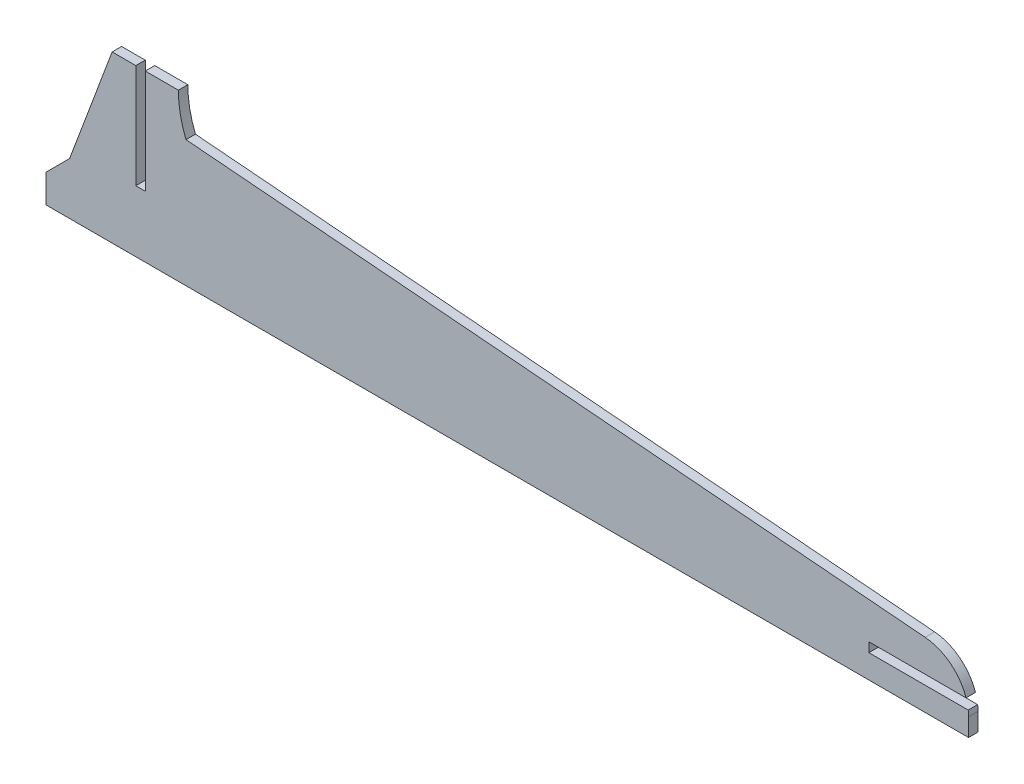
ISO-10303-21;
HEADER;
FILE_DESCRIPTION(('STEP AP214'),'2;1');
FILE_NAME('part.step','',(''),(''),'','','');
FILE_SCHEMA(('AUTOMOTIVE_DESIGN { 1 0 10303 214 1 1 1 1 }'));
ENDSEC;
DATA;
#1=APPLICATION_CONTEXT('core data for automotive mechanical design processes');
#2=APPLICATION_PROTOCOL_DEFINITION('international standard','automotive_design',2000,#1);
#3=PRODUCT_CONTEXT('',#1,'mechanical');
#4=PRODUCT('Part','Part','',(#3));
#5=PRODUCT_RELATED_PRODUCT_CATEGORY('part','',(#4));
#6=PRODUCT_DEFINITION_FORMATION('','',#4);
#7=PRODUCT_DEFINITION_CONTEXT('part definition',#1,'design');
#8=PRODUCT_DEFINITION('design','',#6,#7);
#9=PRODUCT_DEFINITION_SHAPE('','',#8);
#10=(LENGTH_UNIT() NAMED_UNIT(*) SI_UNIT(.MILLI.,.METRE.));
#11=(NAMED_UNIT(*) PLANE_ANGLE_UNIT() SI_UNIT($,.RADIAN.));
#12=(NAMED_UNIT(*) SI_UNIT($,.STERADIAN.) SOLID_ANGLE_UNIT());
#13=UNCERTAINTY_MEASURE_WITH_UNIT(LENGTH_MEASURE(1.E-05),#10,'distance_accuracy_value','');
#14=(GEOMETRIC_REPRESENTATION_CONTEXT(3) GLOBAL_UNCERTAINTY_ASSIGNED_CONTEXT((#13)) GLOBAL_UNIT_ASSIGNED_CONTEXT((#10,
#11,#12)) REPRESENTATION_CONTEXT('',''));
#15=CARTESIAN_POINT('',(0.,0.,0.));
#16=DIRECTION('',(0.,0.,1.));
#17=DIRECTION('',(1.,0.,0.));
#18=AXIS2_PLACEMENT_3D('',#15,#16,#17);
#19=CARTESIAN_POINT('',(85.6103921399042,-10.3842909651718,2.));
#20=DIRECTION('',(0.,0.,-1.));
#21=DIRECTION('',(-1.,0.,0.));
#22=AXIS2_PLACEMENT_3D('',#19,#20,#21);
#23=CYLINDRICAL_SURFACE('',#22,10.);
#24=CARTESIAN_POINT('',(85.6103921399042,-10.3842909651718,0.));
#25=DIRECTION('',(0.,0.,1.));
#26=DIRECTION('',(1.,0.,0.));
#27=AXIS2_PLACEMENT_3D('',#24,#25,#26);
#28=CIRCLE('',#27,10.);
#29=CARTESIAN_POINT('',(95.6103921399042,-10.3842909651718,0.));
#30=VERTEX_POINT('',#29);
#31=CARTESIAN_POINT('',(95.537713689397,-9.18084306311038,0.));
#32=VERTEX_POINT('',#31);
#33=EDGE_CURVE('E186',#30,#32,#28,.T.);
#34=ORIENTED_EDGE('',*,*,#33,.T.);
#35=DIRECTION('',(0.,0.,-1.));
#36=VECTOR('',#35,1.);
#37=CARTESIAN_POINT('',(95.537713689397,-9.18084306311038,2.));
#38=LINE('',#37,#36);
#39=CARTESIAN_POINT('',(95.537713689397,-9.18084306311038,2.));
#40=VERTEX_POINT('',#39);
#41=EDGE_CURVE('E11',#40,#32,#38,.T.);
#42=ORIENTED_EDGE('',*,*,#41,.F.);
#43=CARTESIAN_POINT('',(85.6103921399042,-10.3842909651718,2.));
#44=DIRECTION('',(0.,0.,1.));
#45=DIRECTION('',(1.,0.,0.));
#46=AXIS2_PLACEMENT_3D('',#43,#44,#45);
#47=CIRCLE('',#46,10.);
#48=CARTESIAN_POINT('',(95.6103921399042,-10.3842909651718,2.));
#49=VERTEX_POINT('',#48);
#50=EDGE_CURVE('E218',#49,#40,#47,.T.);
#51=ORIENTED_EDGE('',*,*,#50,.F.);
#52=DIRECTION('',(0.,0.,-1.));
#53=VECTOR('',#52,1.);
#54=CARTESIAN_POINT('',(95.6103921399042,-10.3842909651718,2.));
#55=LINE('',#54,#53);
#56=EDGE_CURVE('E182',#49,#30,#55,.T.);
#57=ORIENTED_EDGE('',*,*,#56,.T.);
#58=EDGE_LOOP('',(#34,#42,#51,#57));
#59=FACE_BOUND('',#58,.T.);
#60=ADVANCED_FACE('F36',(#59),#23,.T.);
#61=CARTESIAN_POINT('',(74.537713689397,-9.18084306311038,2.));
#62=DIRECTION('',(0.,-1.,0.));
#63=DIRECTION('',(1.,0.,0.));
#64=AXIS2_PLACEMENT_3D('',#61,#62,#63);
#65=PLANE('',#64);
#66=DIRECTION('',(-1.,0.,0.));
#67=VECTOR('',#66,1.);
#68=CARTESIAN_POINT('',(74.537713689397,-9.18084306311038,0.));
#69=LINE('',#68,#67);
#70=CARTESIAN_POINT('',(74.537713689397,-9.18084306311038,0.));
#71=VERTEX_POINT('',#70);
#72=EDGE_CURVE('E189',#32,#71,#69,.T.);
#73=ORIENTED_EDGE('',*,*,#72,.T.);
#74=DIRECTION('',(0.,0.,-1.));
#75=VECTOR('',#74,1.);
#76=CARTESIAN_POINT('',(74.537713689397,-9.18084306311038,2.));
#77=LINE('',#76,#75);
#78=CARTESIAN_POINT('',(74.537713689397,-9.18084306311038,2.));
#79=VERTEX_POINT('',#78);
#80=EDGE_CURVE('E44',#79,#71,#77,.T.);
#81=ORIENTED_EDGE('',*,*,#80,.F.);
#82=DIRECTION('',(-1.,0.,0.));
#83=VECTOR('',#82,1.);
#84=CARTESIAN_POINT('',(74.537713689397,-9.18084306311038,2.));
#85=LINE('',#84,#83);
#86=EDGE_CURVE('E122',#40,#79,#85,.T.);
#87=ORIENTED_EDGE('',*,*,#86,.F.);
#88=ORIENTED_EDGE('',*,*,#41,.T.);
#89=EDGE_LOOP('',(#73,#81,#87,#88));
#90=FACE_BOUND('',#89,.T.);
#91=ADVANCED_FACE('F321',(#90),#65,.F.);
#92=CARTESIAN_POINT('',(74.537713689397,-7.18084306311038,2.));
#93=DIRECTION('',(-1.,0.,0.));
#94=DIRECTION('',(0.,-1.,0.));
#95=AXIS2_PLACEMENT_3D('',#92,#93,#94);
#96=PLANE('',#95);
#97=DIRECTION('',(0.,1.,0.));
#98=VECTOR('',#97,1.);
#99=CARTESIAN_POINT('',(74.537713689397,-7.18084306311038,0.));
#100=LINE('',#99,#98);
#101=CARTESIAN_POINT('',(74.537713689397,-7.18084306311038,0.));
#102=VERTEX_POINT('',#101);
#103=EDGE_CURVE('E191',#71,#102,#100,.T.);
#104=ORIENTED_EDGE('',*,*,#103,.T.);
#105=DIRECTION('',(0.,0.,-1.));
#106=VECTOR('',#105,1.);
#107=CARTESIAN_POINT('',(74.537713689397,-7.18084306311038,2.));
#108=LINE('',#107,#106);
#109=CARTESIAN_POINT('',(74.537713689397,-7.18084306311038,2.));
#110=VERTEX_POINT('',#109);
#111=EDGE_CURVE('E252',#110,#102,#108,.T.);
#112=ORIENTED_EDGE('',*,*,#111,.F.);
#113=DIRECTION('',(0.,1.,0.));
#114=VECTOR('',#113,1.);
#115=CARTESIAN_POINT('',(74.537713689397,-7.18084306311038,2.));
#116=LINE('',#115,#114);
#117=EDGE_CURVE('E260',#79,#110,#116,.T.);
#118=ORIENTED_EDGE('',*,*,#117,.F.);
#119=ORIENTED_EDGE('',*,*,#80,.T.);
#120=EDGE_LOOP('',(#104,#112,#118,#119));
#121=FACE_BOUND('',#120,.T.);
#122=ADVANCED_FACE('F258',(#121),#96,.F.);
#123=CARTESIAN_POINT('',(74.537713689397,-7.18084306311038,2.));
#124=DIRECTION('',(0.,1.,0.));
#125=DIRECTION('',(0.,0.,1.));
#126=AXIS2_PLACEMENT_3D('',#123,#124,#125);
#127=PLANE('',#126);
#128=DIRECTION('',(1.,0.,0.));
#129=VECTOR('',#128,1.);
#130=CARTESIAN_POINT('',(74.537713689397,-7.18084306311038,0.));
#131=LINE('',#130,#129);
#132=CARTESIAN_POINT('',(95.0834023024016,-7.18084306311038,0.));
#133=VERTEX_POINT('',#132);
#134=EDGE_CURVE('E193',#102,#133,#131,.T.);
#135=ORIENTED_EDGE('',*,*,#134,.T.);
#136=DIRECTION('',(0.,0.,-1.));
#137=VECTOR('',#136,1.);
#138=CARTESIAN_POINT('',(95.0834023024016,-7.18084306311038,2.));
#139=LINE('',#138,#137);
#140=CARTESIAN_POINT('',(95.0834023024016,-7.18084306311038,2.));
#141=VERTEX_POINT('',#140);
#142=EDGE_CURVE('E249',#141,#133,#139,.T.);
#143=ORIENTED_EDGE('',*,*,#142,.F.);
#144=DIRECTION('',(1.,0.,0.));
#145=VECTOR('',#144,1.);
#146=CARTESIAN_POINT('',(74.537713689397,-7.18084306311038,2.));
#147=LINE('',#146,#145);
#148=EDGE_CURVE('E278',#110,#141,#147,.T.);
#149=ORIENTED_EDGE('',*,*,#148,.F.);
#150=ORIENTED_EDGE('',*,*,#111,.T.);
#151=EDGE_LOOP('',(#135,#143,#149,#150));
#152=FACE_BOUND('',#151,.T.);
#153=ADVANCED_FACE('F269',(#152),#127,.F.);
#154=CARTESIAN_POINT('',(85.6103921399042,-10.3842909651718,2.));
#155=DIRECTION('',(0.,0.,-1.));
#156=DIRECTION('',(-1.,0.,0.));
#157=AXIS2_PLACEMENT_3D('',#154,#155,#156);
#158=CYLINDRICAL_SURFACE('',#157,10.);
#159=CARTESIAN_POINT('',(85.6103921399042,-10.3842909651718,0.));
#160=DIRECTION('',(0.,0.,1.));
#161=DIRECTION('',(1.,0.,0.));
#162=AXIS2_PLACEMENT_3D('',#159,#160,#161);
#163=CIRCLE('',#162,10.);
#164=CARTESIAN_POINT('',(86.4385600188425,-0.418643070313409,0.));
#165=VERTEX_POINT('',#164);
#166=EDGE_CURVE('E195',#133,#165,#163,.T.);
#167=ORIENTED_EDGE('',*,*,#166,.T.);
#168=DIRECTION('',(0.,0.,-1.));
#169=VECTOR('',#168,1.);
#170=CARTESIAN_POINT('',(86.4385600188425,-0.418643070313409,2.));
#171=LINE('',#170,#169);
#172=CARTESIAN_POINT('',(86.4385600188425,-0.418643070313409,2.));
#173=VERTEX_POINT('',#172);
#174=EDGE_CURVE('E246',#173,#165,#171,.T.);
#175=ORIENTED_EDGE('',*,*,#174,.F.);
#176=CARTESIAN_POINT('',(85.6103921399042,-10.3842909651718,2.));
#177=DIRECTION('',(0.,0.,1.));
#178=DIRECTION('',(1.,0.,0.));
#179=AXIS2_PLACEMENT_3D('',#176,#177,#178);
#180=CIRCLE('',#179,10.);
#181=EDGE_CURVE('E275',#141,#173,#180,.T.);
#182=ORIENTED_EDGE('',*,*,#181,.F.);
#183=ORIENTED_EDGE('',*,*,#142,.T.);
#184=EDGE_LOOP('',(#167,#175,#182,#183));
#185=FACE_BOUND('',#184,.T.);
#186=ADVANCED_FACE('F273',(#185),#158,.T.);
#187=CARTESIAN_POINT('',(-69.8017208567902,12.5652776323497,2.));
#188=DIRECTION('',(-0.0828167878938338,-0.996564789485836,0.));
#189=DIRECTION('',(0.996564789485836,-0.0828167878938338,0.));
#190=AXIS2_PLACEMENT_3D('',#187,#188,#189);
#191=PLANE('',#190);
#192=DIRECTION('',(-0.996564789485836,0.0828167878938338,0.));
#193=VECTOR('',#192,1.);
#194=CARTESIAN_POINT('',(-69.8017208567902,12.5652776323497,0.));
#195=LINE('',#194,#193);
#196=CARTESIAN_POINT('',(-69.8017208567902,12.5652776323498,0.));
#197=VERTEX_POINT('',#196);
#198=EDGE_CURVE('E197',#165,#197,#195,.T.);
#199=ORIENTED_EDGE('',*,*,#198,.T.);
#200=DIRECTION('',(0.,0.,-1.));
#201=VECTOR('',#200,1.);
#202=CARTESIAN_POINT('',(-69.8017208567902,12.5652776323498,2.));
#203=LINE('',#202,#201);
#204=CARTESIAN_POINT('',(-69.8017208567902,12.5652776323498,2.));
#205=VERTEX_POINT('',#204);
#206=EDGE_CURVE('E243',#205,#197,#203,.T.);
#207=ORIENTED_EDGE('',*,*,#206,.F.);
#208=DIRECTION('',(-0.996564789485836,0.0828167878938338,0.));
#209=VECTOR('',#208,1.);
#210=CARTESIAN_POINT('',(-69.8017208567902,12.5652776323497,2.));
#211=LINE('',#210,#209);
#212=EDGE_CURVE('E277',#173,#205,#211,.T.);
#213=ORIENTED_EDGE('',*,*,#212,.F.);
#214=ORIENTED_EDGE('',*,*,#174,.T.);
#215=EDGE_LOOP('',(#199,#207,#213,#214));
#216=FACE_BOUND('',#215,.T.);
#217=ADVANCED_FACE('F334',(#216),#191,.F.);
#218=CARTESIAN_POINT('',(-49.4352382364816,20.8191569368896,2.));
#219=DIRECTION('',(0.,0.,-1.));
#220=DIRECTION('',(-1.,0.,0.));
#221=AXIS2_PLACEMENT_3D('',#218,#219,#220);
#222=CYLINDRICAL_SURFACE('',#221,21.9754439749745);
#223=CARTESIAN_POINT('',(-49.4352382364816,20.8191569368896,0.));
#224=DIRECTION('',(0.,0.,-1.));
#225=DIRECTION('',(1.,0.,0.));
#226=AXIS2_PLACEMENT_3D('',#223,#224,#225);
#227=CIRCLE('',#226,21.9754439749745);
#228=CARTESIAN_POINT('',(-71.4106822114561,20.8191569368896,0.));
#229=VERTEX_POINT('',#228);
#230=EDGE_CURVE('E199',#197,#229,#227,.T.);
#231=ORIENTED_EDGE('',*,*,#230,.T.);
#232=DIRECTION('',(0.,0.,-1.));
#233=VECTOR('',#232,1.);
#234=CARTESIAN_POINT('',(-71.4106822114561,20.8191569368896,2.));
#235=LINE('',#234,#233);
#236=CARTESIAN_POINT('',(-71.4106822114561,20.8191569368896,2.));
#237=VERTEX_POINT('',#236);
#238=EDGE_CURVE('E240',#237,#229,#235,.T.);
#239=ORIENTED_EDGE('',*,*,#238,.F.);
#240=CARTESIAN_POINT('',(-49.4352382364816,20.8191569368896,2.));
#241=DIRECTION('',(0.,0.,-1.));
#242=DIRECTION('',(1.,0.,0.));
#243=AXIS2_PLACEMENT_3D('',#240,#241,#242);
#244=CIRCLE('',#243,21.9754439749745);
#245=EDGE_CURVE('E280',#205,#237,#244,.T.);
#246=ORIENTED_EDGE('',*,*,#245,.F.);
#247=ORIENTED_EDGE('',*,*,#206,.T.);
#248=EDGE_LOOP('',(#231,#239,#246,#247));
#249=FACE_BOUND('',#248,.T.);
#250=ADVANCED_FACE('F337',(#249),#222,.F.);
#251=CARTESIAN_POINT('',(-78.4106822114561,20.8191569368896,2.));
#252=DIRECTION('',(0.,-1.,0.));
#253=DIRECTION('',(0.,0.,-1.));
#254=AXIS2_PLACEMENT_3D('',#251,#252,#253);
#255=PLANE('',#254);
#256=DIRECTION('',(-1.,0.,0.));
#257=VECTOR('',#256,1.);
#258=CARTESIAN_POINT('',(-78.4106822114561,20.8191569368896,0.));
#259=LINE('',#258,#257);
#260=CARTESIAN_POINT('',(-78.4106822114561,20.8191569368896,0.));
#261=VERTEX_POINT('',#260);
#262=EDGE_CURVE('E201',#229,#261,#259,.T.);
#263=ORIENTED_EDGE('',*,*,#262,.T.);
#264=DIRECTION('',(0.,0.,-1.));
#265=VECTOR('',#264,1.);
#266=CARTESIAN_POINT('',(-78.4106822114561,20.8191569368896,2.));
#267=LINE('',#266,#265);
#268=CARTESIAN_POINT('',(-78.4106822114561,20.8191569368896,2.));
#269=VERTEX_POINT('',#268);
#270=EDGE_CURVE('E237',#269,#261,#267,.T.);
#271=ORIENTED_EDGE('',*,*,#270,.F.);
#272=DIRECTION('',(-1.,0.,0.));
#273=VECTOR('',#272,1.);
#274=CARTESIAN_POINT('',(-78.4106822114561,20.8191569368896,2.));
#275=LINE('',#274,#273);
#276=EDGE_CURVE('E286',#237,#269,#275,.T.);
#277=ORIENTED_EDGE('',*,*,#276,.F.);
#278=ORIENTED_EDGE('',*,*,#238,.T.);
#279=EDGE_LOOP('',(#263,#271,#277,#278));
#280=FACE_BOUND('',#279,.T.);
#281=ADVANCED_FACE('F341',(#280),#255,.F.);
#282=CARTESIAN_POINT('',(-78.4106822114561,20.8191569368896,2.));
#283=DIRECTION('',(1.,0.,0.));
#284=DIRECTION('',(0.,0.,-1.));
#285=AXIS2_PLACEMENT_3D('',#282,#283,#284);
#286=PLANE('',#285);
#287=DIRECTION('',(0.,-1.,0.));
#288=VECTOR('',#287,1.);
#289=CARTESIAN_POINT('',(-78.4106822114561,20.8191569368896,0.));
#290=LINE('',#289,#288);
#291=CARTESIAN_POINT('',(-78.4106822114561,-1.18084306311037,0.));
#292=VERTEX_POINT('',#291);
#293=EDGE_CURVE('E203',#261,#292,#290,.T.);
#294=ORIENTED_EDGE('',*,*,#293,.T.);
#295=DIRECTION('',(0.,0.,-1.));
#296=VECTOR('',#295,1.);
#297=CARTESIAN_POINT('',(-78.4106822114561,-1.18084306311037,2.));
#298=LINE('',#297,#296);
#299=CARTESIAN_POINT('',(-78.4106822114561,-1.18084306311037,2.));
#300=VERTEX_POINT('',#299);
#301=EDGE_CURVE('E234',#300,#292,#298,.T.);
#302=ORIENTED_EDGE('',*,*,#301,.F.);
#303=DIRECTION('',(0.,-1.,0.));
#304=VECTOR('',#303,1.);
#305=CARTESIAN_POINT('',(-78.4106822114561,20.8191569368896,2.));
#306=LINE('',#305,#304);
#307=EDGE_CURVE('E288',#269,#300,#306,.T.);
#308=ORIENTED_EDGE('',*,*,#307,.F.);
#309=ORIENTED_EDGE('',*,*,#270,.T.);
#310=EDGE_LOOP('',(#294,#302,#308,#309));
#311=FACE_BOUND('',#310,.T.);
#312=ADVANCED_FACE('F345',(#311),#286,.F.);
#313=CARTESIAN_POINT('',(-78.4106822114561,-1.18084306311037,2.));
#314=DIRECTION('',(0.,-1.,0.));
#315=DIRECTION('',(0.,0.,-1.));
#316=AXIS2_PLACEMENT_3D('',#313,#314,#315);
#317=PLANE('',#316);
#318=DIRECTION('',(-1.,0.,0.));
#319=VECTOR('',#318,1.);
#320=CARTESIAN_POINT('',(-78.4106822114561,-1.18084306311037,0.));
#321=LINE('',#320,#319);
#322=CARTESIAN_POINT('',(-80.4106822114561,-1.18084306311037,0.));
#323=VERTEX_POINT('',#322);
#324=EDGE_CURVE('E205',#292,#323,#321,.T.);
#325=ORIENTED_EDGE('',*,*,#324,.T.);
#326=DIRECTION('',(0.,0.,-1.));
#327=VECTOR('',#326,1.);
#328=CARTESIAN_POINT('',(-80.4106822114561,-1.18084306311037,2.));
#329=LINE('',#328,#327);
#330=CARTESIAN_POINT('',(-80.4106822114561,-1.18084306311037,2.));
#331=VERTEX_POINT('',#330);
#332=EDGE_CURVE('E231',#331,#323,#329,.T.);
#333=ORIENTED_EDGE('',*,*,#332,.F.);
#334=DIRECTION('',(-1.,0.,0.));
#335=VECTOR('',#334,1.);
#336=CARTESIAN_POINT('',(-78.4106822114561,-1.18084306311037,2.));
#337=LINE('',#336,#335);
#338=EDGE_CURVE('E290',#300,#331,#337,.T.);
#339=ORIENTED_EDGE('',*,*,#338,.F.);
#340=ORIENTED_EDGE('',*,*,#301,.T.);
#341=EDGE_LOOP('',(#325,#333,#339,#340));
#342=FACE_BOUND('',#341,.T.);
#343=ADVANCED_FACE('F349',(#342),#317,.F.);
#344=CARTESIAN_POINT('',(-80.4106822114561,20.8191569368896,2.));
#345=DIRECTION('',(-1.,0.,0.));
#346=DIRECTION('',(0.,0.,1.));
#347=AXIS2_PLACEMENT_3D('',#344,#345,#346);
#348=PLANE('',#347);
#349=DIRECTION('',(0.,1.,0.));
#350=VECTOR('',#349,1.);
#351=CARTESIAN_POINT('',(-80.4106822114561,20.8191569368896,0.));
#352=LINE('',#351,#350);
#353=CARTESIAN_POINT('',(-80.4106822114561,20.8191569368896,0.));
#354=VERTEX_POINT('',#353);
#355=EDGE_CURVE('E207',#323,#354,#352,.T.);
#356=ORIENTED_EDGE('',*,*,#355,.T.);
#357=DIRECTION('',(0.,0.,-1.));
#358=VECTOR('',#357,1.);
#359=CARTESIAN_POINT('',(-80.4106822114561,20.8191569368896,2.));
#360=LINE('',#359,#358);
#361=CARTESIAN_POINT('',(-80.4106822114561,20.8191569368896,2.));
#362=VERTEX_POINT('',#361);
#363=EDGE_CURVE('E228',#362,#354,#360,.T.);
#364=ORIENTED_EDGE('',*,*,#363,.F.);
#365=DIRECTION('',(0.,1.,0.));
#366=VECTOR('',#365,1.);
#367=CARTESIAN_POINT('',(-80.4106822114561,20.8191569368896,2.));
#368=LINE('',#367,#366);
#369=EDGE_CURVE('E292',#331,#362,#368,.T.);
#370=ORIENTED_EDGE('',*,*,#369,.F.);
#371=ORIENTED_EDGE('',*,*,#332,.T.);
#372=EDGE_LOOP('',(#356,#364,#370,#371));
#373=FACE_BOUND('',#372,.T.);
#374=ADVANCED_FACE('F353',(#373),#348,.F.);
#375=CARTESIAN_POINT('',(-85.4106822114561,20.8191569368896,2.));
#376=DIRECTION('',(0.,-1.,0.));
#377=DIRECTION('',(0.,0.,-1.));
#378=AXIS2_PLACEMENT_3D('',#375,#376,#377);
#379=PLANE('',#378);
#380=DIRECTION('',(-1.,0.,0.));
#381=VECTOR('',#380,1.);
#382=CARTESIAN_POINT('',(-85.4106822114561,20.8191569368896,0.));
#383=LINE('',#382,#381);
#384=CARTESIAN_POINT('',(-85.4106822114561,20.8191569368896,0.));
#385=VERTEX_POINT('',#384);
#386=EDGE_CURVE('E209',#354,#385,#383,.T.);
#387=ORIENTED_EDGE('',*,*,#386,.T.);
#388=DIRECTION('',(0.,0.,-1.));
#389=VECTOR('',#388,1.);
#390=CARTESIAN_POINT('',(-85.4106822114561,20.8191569368896,2.));
#391=LINE('',#390,#389);
#392=CARTESIAN_POINT('',(-85.4106822114561,20.8191569368896,2.));
#393=VERTEX_POINT('',#392);
#394=EDGE_CURVE('E225',#393,#385,#391,.T.);
#395=ORIENTED_EDGE('',*,*,#394,.F.);
#396=DIRECTION('',(-1.,0.,0.));
#397=VECTOR('',#396,1.);
#398=CARTESIAN_POINT('',(-85.4106822114561,20.8191569368896,2.));
#399=LINE('',#398,#397);
#400=EDGE_CURVE('E294',#362,#393,#399,.T.);
#401=ORIENTED_EDGE('',*,*,#400,.F.);
#402=ORIENTED_EDGE('',*,*,#363,.T.);
#403=EDGE_LOOP('',(#387,#395,#401,#402));
#404=FACE_BOUND('',#403,.T.);
#405=ADVANCED_FACE('F357',(#404),#379,.F.);
#406=CARTESIAN_POINT('',(-94.3896078600958,-3.18084306311037,2.));
#407=DIRECTION('',(0.936599286558836,-0.3504023065242,0.));
#408=DIRECTION('',(0.3504023065242,0.936599286558836,0.));
#409=AXIS2_PLACEMENT_3D('',#406,#407,#408);
#410=PLANE('',#409);
#411=DIRECTION('',(-0.3504023065242,-0.936599286558836,0.));
#412=VECTOR('',#411,1.);
#413=CARTESIAN_POINT('',(-94.3896078600958,-3.18084306311037,0.));
#414=LINE('',#413,#412);
#415=CARTESIAN_POINT('',(-94.3896078600958,-3.18084306311037,0.));
#416=VERTEX_POINT('',#415);
#417=EDGE_CURVE('E211',#385,#416,#414,.T.);
#418=ORIENTED_EDGE('',*,*,#417,.T.);
#419=DIRECTION('',(0.,0.,-1.));
#420=VECTOR('',#419,1.);
#421=CARTESIAN_POINT('',(-94.3896078600958,-3.18084306311037,2.));
#422=LINE('',#421,#420);
#423=CARTESIAN_POINT('',(-94.3896078600958,-3.18084306311037,2.));
#424=VERTEX_POINT('',#423);
#425=EDGE_CURVE('E222',#424,#416,#422,.T.);
#426=ORIENTED_EDGE('',*,*,#425,.F.);
#427=DIRECTION('',(-0.3504023065242,-0.936599286558836,0.));
#428=VECTOR('',#427,1.);
#429=CARTESIAN_POINT('',(-94.3896078600958,-3.18084306311037,2.));
#430=LINE('',#429,#428);
#431=EDGE_CURVE('E296',#393,#424,#430,.T.);
#432=ORIENTED_EDGE('',*,*,#431,.F.);
#433=ORIENTED_EDGE('',*,*,#394,.T.);
#434=EDGE_LOOP('',(#418,#426,#432,#433));
#435=FACE_BOUND('',#434,.T.);
#436=ADVANCED_FACE('F302',(#435),#410,.F.);
#437=CARTESIAN_POINT('',(-99.3896078600958,-8.18084306311038,2.));
#438=DIRECTION('',(0.707106781186548,-0.707106781186547,0.));
#439=DIRECTION('',(0.707106781186547,0.707106781186548,0.));
#440=AXIS2_PLACEMENT_3D('',#437,#438,#439);
#441=PLANE('',#440);
#442=DIRECTION('',(-0.707106781186547,-0.707106781186548,0.));
#443=VECTOR('',#442,1.);
#444=CARTESIAN_POINT('',(-99.3896078600958,-8.18084306311038,0.));
#445=LINE('',#444,#443);
#446=CARTESIAN_POINT('',(-99.3896078600958,-8.18084306311038,0.));
#447=VERTEX_POINT('',#446);
#448=EDGE_CURVE('E213',#416,#447,#445,.T.);
#449=ORIENTED_EDGE('',*,*,#448,.T.);
#450=DIRECTION('',(0.,0.,-1.));
#451=VECTOR('',#450,1.);
#452=CARTESIAN_POINT('',(-99.3896078600958,-8.18084306311038,2.));
#453=LINE('',#452,#451);
#454=CARTESIAN_POINT('',(-99.3896078600958,-8.18084306311038,2.));
#455=VERTEX_POINT('',#454);
#456=EDGE_CURVE('E177',#455,#447,#453,.T.);
#457=ORIENTED_EDGE('',*,*,#456,.F.);
#458=DIRECTION('',(-0.707106781186547,-0.707106781186548,0.));
#459=VECTOR('',#458,1.);
#460=CARTESIAN_POINT('',(-99.3896078600958,-8.18084306311038,2.));
#461=LINE('',#460,#459);
#462=EDGE_CURVE('E168',#424,#455,#461,.T.);
#463=ORIENTED_EDGE('',*,*,#462,.F.);
#464=ORIENTED_EDGE('',*,*,#425,.T.);
#465=EDGE_LOOP('',(#449,#457,#463,#464));
#466=FACE_BOUND('',#465,.T.);
#467=ADVANCED_FACE('F306',(#466),#441,.F.);
#468=CARTESIAN_POINT('',(-99.3896078600958,-14.1808430631104,2.));
#469=DIRECTION('',(1.,0.,0.));
#470=DIRECTION('',(0.,0.,-1.));
#471=AXIS2_PLACEMENT_3D('',#468,#469,#470);
#472=PLANE('',#471);
#473=DIRECTION('',(0.,-1.,0.));
#474=VECTOR('',#473,1.);
#475=CARTESIAN_POINT('',(-99.3896078600958,-14.1808430631104,0.));
#476=LINE('',#475,#474);
#477=CARTESIAN_POINT('',(-99.3896078600958,-14.1808430631104,0.));
#478=VERTEX_POINT('',#477);
#479=EDGE_CURVE('E176',#447,#478,#476,.T.);
#480=ORIENTED_EDGE('',*,*,#479,.T.);
#481=DIRECTION('',(0.,0.,-1.));
#482=VECTOR('',#481,1.);
#483=CARTESIAN_POINT('',(-99.3896078600958,-14.1808430631104,2.));
#484=LINE('',#483,#482);
#485=CARTESIAN_POINT('',(-99.3896078600958,-14.1808430631104,2.));
#486=VERTEX_POINT('',#485);
#487=EDGE_CURVE('E173',#486,#478,#484,.T.);
#488=ORIENTED_EDGE('',*,*,#487,.F.);
#489=DIRECTION('',(0.,-1.,0.));
#490=VECTOR('',#489,1.);
#491=CARTESIAN_POINT('',(-99.3896078600958,-14.1808430631104,2.));
#492=LINE('',#491,#490);
#493=EDGE_CURVE('E162',#455,#486,#492,.T.);
#494=ORIENTED_EDGE('',*,*,#493,.F.);
#495=ORIENTED_EDGE('',*,*,#456,.T.);
#496=EDGE_LOOP('',(#480,#488,#494,#495));
#497=FACE_BOUND('',#496,.T.);
#498=ADVANCED_FACE('F174',(#497),#472,.F.);
#499=CARTESIAN_POINT('',(-99.3896078600958,-14.1808430631104,2.));
#500=DIRECTION('',(0.,1.,0.));
#501=DIRECTION('',(0.,0.,1.));
#502=AXIS2_PLACEMENT_3D('',#499,#500,#501);
#503=PLANE('',#502);
#504=DIRECTION('',(1.,0.,0.));
#505=VECTOR('',#504,1.);
#506=CARTESIAN_POINT('',(-99.3896078600958,-14.1808430631104,0.));
#507=LINE('',#506,#505);
#508=CARTESIAN_POINT('',(95.6103921399042,-14.1808430631104,0.));
#509=VERTEX_POINT('',#508);
#510=EDGE_CURVE('E108',#478,#509,#507,.T.);
#511=ORIENTED_EDGE('',*,*,#510,.T.);
#512=DIRECTION('',(0.,0.,-1.));
#513=VECTOR('',#512,1.);
#514=CARTESIAN_POINT('',(95.6103921399042,-14.1808430631104,2.));
#515=LINE('',#514,#513);
#516=CARTESIAN_POINT('',(95.6103921399042,-14.1808430631104,2.));
#517=VERTEX_POINT('',#516);
#518=EDGE_CURVE('E178',#517,#509,#515,.T.);
#519=ORIENTED_EDGE('',*,*,#518,.F.);
#520=DIRECTION('',(1.,0.,0.));
#521=VECTOR('',#520,1.);
#522=CARTESIAN_POINT('',(-99.3896078600958,-14.1808430631104,2.));
#523=LINE('',#522,#521);
#524=EDGE_CURVE('E166',#486,#517,#523,.T.);
#525=ORIENTED_EDGE('',*,*,#524,.F.);
#526=ORIENTED_EDGE('',*,*,#487,.T.);
#527=EDGE_LOOP('',(#511,#519,#525,#526));
#528=FACE_BOUND('',#527,.T.);
#529=ADVANCED_FACE('F180',(#528),#503,.F.);
#530=CARTESIAN_POINT('',(95.6103921399042,-14.1808430631104,2.));
#531=DIRECTION('',(-1.,0.,0.));
#532=DIRECTION('',(0.,-1.,0.));
#533=AXIS2_PLACEMENT_3D('',#530,#531,#532);
#534=PLANE('',#533);
#535=DIRECTION('',(0.,1.,0.));
#536=VECTOR('',#535,1.);
#537=CARTESIAN_POINT('',(95.6103921399042,-14.1808430631104,0.));
#538=LINE('',#537,#536);
#539=EDGE_CURVE('E114',#509,#30,#538,.T.);
#540=ORIENTED_EDGE('',*,*,#539,.T.);
#541=ORIENTED_EDGE('',*,*,#56,.F.);
#542=DIRECTION('',(0.,1.,0.));
#543=VECTOR('',#542,1.);
#544=CARTESIAN_POINT('',(95.6103921399042,-14.1808430631104,2.));
#545=LINE('',#544,#543);
#546=EDGE_CURVE('E52',#517,#49,#545,.T.);
#547=ORIENTED_EDGE('',*,*,#546,.F.);
#548=ORIENTED_EDGE('',*,*,#518,.T.);
#549=EDGE_LOOP('',(#540,#541,#547,#548));
#550=FACE_BOUND('',#549,.T.);
#551=ADVANCED_FACE('F310',(#550),#534,.F.);
#552=CARTESIAN_POINT('',(85.6103921399042,-10.3842909651718,2.));
#553=DIRECTION('',(0.,0.,1.));
#554=DIRECTION('',(1.,0.,0.));
#555=AXIS2_PLACEMENT_3D('',#552,#553,#554);
#556=PLANE('',#555);
#557=ORIENTED_EDGE('',*,*,#50,.T.);
#558=ORIENTED_EDGE('',*,*,#86,.T.);
#559=ORIENTED_EDGE('',*,*,#117,.T.);
#560=ORIENTED_EDGE('',*,*,#148,.T.);
#561=ORIENTED_EDGE('',*,*,#181,.T.);
#562=ORIENTED_EDGE('',*,*,#212,.T.);
#563=ORIENTED_EDGE('',*,*,#245,.T.);
#564=ORIENTED_EDGE('',*,*,#276,.T.);
#565=ORIENTED_EDGE('',*,*,#307,.T.);
#566=ORIENTED_EDGE('',*,*,#338,.T.);
#567=ORIENTED_EDGE('',*,*,#369,.T.);
#568=ORIENTED_EDGE('',*,*,#400,.T.);
#569=ORIENTED_EDGE('',*,*,#431,.T.);
#570=ORIENTED_EDGE('',*,*,#462,.T.);
#571=ORIENTED_EDGE('',*,*,#493,.T.);
#572=ORIENTED_EDGE('',*,*,#524,.T.);
#573=ORIENTED_EDGE('',*,*,#546,.T.);
#574=EDGE_LOOP('',(#557,#558,#559,#560,#561,#562,#563,#564,#565,#566,#567,#568,#569,#570,#571,
#572,#573));
#575=FACE_BOUND('',#574,.T.);
#576=ADVANCED_FACE('F164',(#575),#556,.T.);
#577=CARTESIAN_POINT('',(85.6103921399042,-10.3842909651718,0.));
#578=DIRECTION('',(0.,0.,1.));
#579=DIRECTION('',(1.,0.,0.));
#580=AXIS2_PLACEMENT_3D('',#577,#578,#579);
#581=PLANE('',#580);
#582=ORIENTED_EDGE('',*,*,#33,.F.);
#583=ORIENTED_EDGE('',*,*,#539,.F.);
#584=ORIENTED_EDGE('',*,*,#510,.F.);
#585=ORIENTED_EDGE('',*,*,#479,.F.);
#586=ORIENTED_EDGE('',*,*,#448,.F.);
#587=ORIENTED_EDGE('',*,*,#417,.F.);
#588=ORIENTED_EDGE('',*,*,#386,.F.);
#589=ORIENTED_EDGE('',*,*,#355,.F.);
#590=ORIENTED_EDGE('',*,*,#324,.F.);
#591=ORIENTED_EDGE('',*,*,#293,.F.);
#592=ORIENTED_EDGE('',*,*,#262,.F.);
#593=ORIENTED_EDGE('',*,*,#230,.F.);
#594=ORIENTED_EDGE('',*,*,#198,.F.);
#595=ORIENTED_EDGE('',*,*,#166,.F.);
#596=ORIENTED_EDGE('',*,*,#134,.F.);
#597=ORIENTED_EDGE('',*,*,#103,.F.);
#598=ORIENTED_EDGE('',*,*,#72,.F.);
#599=EDGE_LOOP('',(#582,#583,#584,#585,#586,#587,#588,#589,#590,#591,#592,#593,#594,#595,#596,
#597,#598));
#600=FACE_BOUND('',#599,.T.);
#601=ADVANCED_FACE('F264',(#600),#581,.F.);
#602=CLOSED_SHELL('',(#60,#91,#122,#153,#186,#217,#250,#281,#312,#343,#374,#405,#436,#467,#498,
#529,#551,#576,#601));
#603=MANIFOLD_SOLID_BREP('B2',#602);
#604=ADVANCED_BREP_SHAPE_REPRESENTATION('',(#18,#603),#14);
#605=SHAPE_DEFINITION_REPRESENTATION(#9,#604);
ENDSEC;
END-ISO-10303-21;
